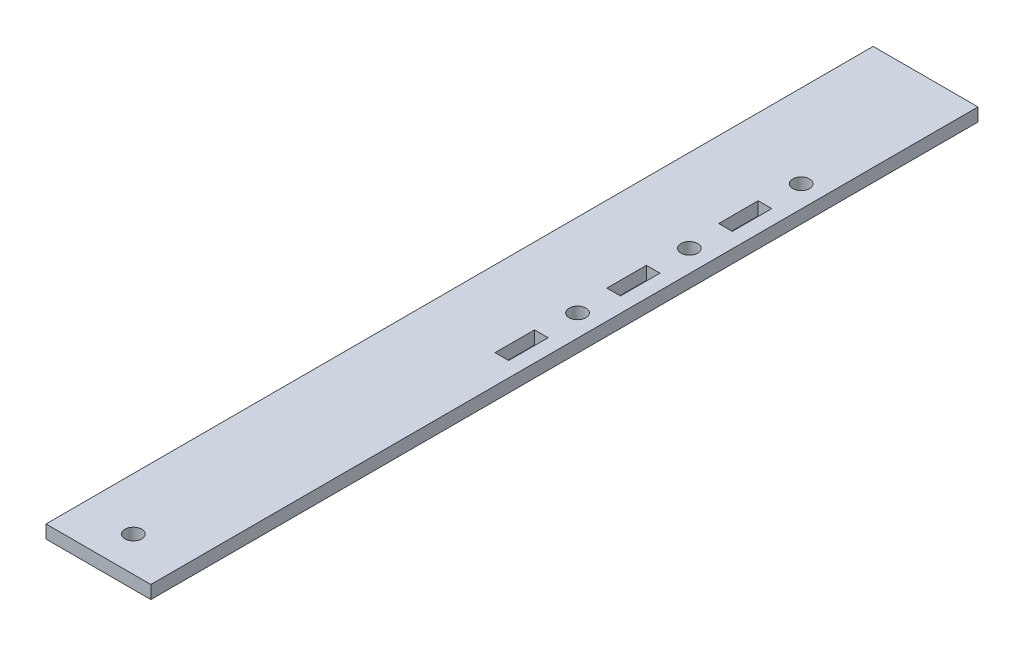
ISO-10303-21;
HEADER;
FILE_DESCRIPTION(('STEP AP214'),'2;1');
FILE_NAME('part.step','',(''),(''),'','','');
FILE_SCHEMA(('AUTOMOTIVE_DESIGN { 1 0 10303 214 1 1 1 1 }'));
ENDSEC;
DATA;
#1=APPLICATION_CONTEXT('core data for automotive mechanical design processes');
#2=APPLICATION_PROTOCOL_DEFINITION('international standard','automotive_design',2000,#1);
#3=PRODUCT_CONTEXT('',#1,'mechanical');
#4=PRODUCT('Part','Part','',(#3));
#5=PRODUCT_RELATED_PRODUCT_CATEGORY('part','',(#4));
#6=PRODUCT_DEFINITION_FORMATION('','',#4);
#7=PRODUCT_DEFINITION_CONTEXT('part definition',#1,'design');
#8=PRODUCT_DEFINITION('design','',#6,#7);
#9=PRODUCT_DEFINITION_SHAPE('','',#8);
#10=(LENGTH_UNIT() NAMED_UNIT(*) SI_UNIT(.MILLI.,.METRE.));
#11=(NAMED_UNIT(*) PLANE_ANGLE_UNIT() SI_UNIT($,.RADIAN.));
#12=(NAMED_UNIT(*) SI_UNIT($,.STERADIAN.) SOLID_ANGLE_UNIT());
#13=UNCERTAINTY_MEASURE_WITH_UNIT(LENGTH_MEASURE(1.E-05),#10,'distance_accuracy_value','');
#14=(GEOMETRIC_REPRESENTATION_CONTEXT(3) GLOBAL_UNCERTAINTY_ASSIGNED_CONTEXT((#13)) GLOBAL_UNIT_ASSIGNED_CONTEXT((#10,
#11,#12)) REPRESENTATION_CONTEXT('',''));
#15=CARTESIAN_POINT('',(0.,0.,0.));
#16=DIRECTION('',(0.,0.,1.));
#17=DIRECTION('',(1.,0.,0.));
#18=AXIS2_PLACEMENT_3D('',#15,#16,#17);
#19=CARTESIAN_POINT('',(19.05,0.,88.9));
#20=DIRECTION('',(0.,1.,0.));
#21=DIRECTION('',(-1.,0.,0.));
#22=AXIS2_PLACEMENT_3D('',#19,#20,#21);
#23=PLANE('',#22);
#24=CARTESIAN_POINT('',(9.525,0.,114.3));
#25=DIRECTION('',(0.,1.,0.));
#26=DIRECTION('',(0.,0.,1.));
#27=AXIS2_PLACEMENT_3D('',#24,#25,#26);
#28=CIRCLE('',#27,1.524);
#29=CARTESIAN_POINT('',(9.525,0.,115.824));
#30=VERTEX_POINT('',#29);
#31=EDGE_CURVE('E183',#30,#30,#28,.T.);
#32=ORIENTED_EDGE('',*,*,#31,.T.);
#33=EDGE_LOOP('',(#32));
#34=FACE_BOUND('',#33,.T.);
#35=DIRECTION('',(0.,0.,-1.));
#36=VECTOR('',#35,1.);
#37=CARTESIAN_POINT('',(16.317595,0.,0.));
#38=LINE('',#37,#36);
#39=CARTESIAN_POINT('',(16.317595,0.,12.2555));
#40=VERTEX_POINT('',#39);
#41=CARTESIAN_POINT('',(16.317595,0.,5.08));
#42=VERTEX_POINT('',#41);
#43=EDGE_CURVE('E203',#40,#42,#38,.T.);
#44=ORIENTED_EDGE('',*,*,#43,.T.);
#45=DIRECTION('',(-1.,0.,0.));
#46=VECTOR('',#45,1.);
#47=CARTESIAN_POINT('',(0.,0.,5.08));
#48=LINE('',#47,#46);
#49=CARTESIAN_POINT('',(13.844905,0.,5.08));
#50=VERTEX_POINT('',#49);
#51=EDGE_CURVE('E192',#42,#50,#48,.T.);
#52=ORIENTED_EDGE('',*,*,#51,.T.);
#53=DIRECTION('',(0.,0.,1.));
#54=VECTOR('',#53,1.);
#55=CARTESIAN_POINT('',(13.844905,0.,0.));
#56=LINE('',#55,#54);
#57=CARTESIAN_POINT('',(13.844905,0.,12.2555));
#58=VERTEX_POINT('',#57);
#59=EDGE_CURVE('E196',#50,#58,#56,.T.);
#60=ORIENTED_EDGE('',*,*,#59,.T.);
#61=DIRECTION('',(1.,0.,0.));
#62=VECTOR('',#61,1.);
#63=CARTESIAN_POINT('',(0.,0.,12.2555));
#64=LINE('',#63,#62);
#65=EDGE_CURVE('E61',#58,#40,#64,.T.);
#66=ORIENTED_EDGE('',*,*,#65,.T.);
#67=EDGE_LOOP('',(#44,#52,#60,#66));
#68=FACE_BOUND('',#67,.T.);
#69=CARTESIAN_POINT('',(15.08125,0.,-1.49225));
#70=DIRECTION('',(0.,1.,0.));
#71=DIRECTION('',(0.,0.,1.));
#72=AXIS2_PLACEMENT_3D('',#69,#70,#71);
#73=CIRCLE('',#72,1.524);
#74=CARTESIAN_POINT('',(15.08125,0.,0.0317499999999964));
#75=VERTEX_POINT('',#74);
#76=EDGE_CURVE('E211',#75,#75,#73,.T.);
#77=ORIENTED_EDGE('',*,*,#76,.T.);
#78=EDGE_LOOP('',(#77));
#79=FACE_BOUND('',#78,.T.);
#80=CARTESIAN_POINT('',(15.08125,0.,18.82775));
#81=DIRECTION('',(0.,1.,0.));
#82=DIRECTION('',(0.,0.,1.));
#83=AXIS2_PLACEMENT_3D('',#80,#81,#82);
#84=CIRCLE('',#83,1.524);
#85=CARTESIAN_POINT('',(15.08125,0.,20.35175));
#86=VERTEX_POINT('',#85);
#87=EDGE_CURVE('E318',#86,#86,#84,.T.);
#88=ORIENTED_EDGE('',*,*,#87,.T.);
#89=EDGE_LOOP('',(#88));
#90=FACE_BOUND('',#89,.T.);
#91=DIRECTION('',(0.,0.,1.));
#92=VECTOR('',#91,1.);
#93=CARTESIAN_POINT('',(16.317595,0.,0.));
#94=LINE('',#93,#92);
#95=CARTESIAN_POINT('',(16.317595,0.,45.72));
#96=VERTEX_POINT('',#95);
#97=CARTESIAN_POINT('',(16.317595,0.,52.8955));
#98=VERTEX_POINT('',#97);
#99=EDGE_CURVE('E253',#96,#98,#94,.T.);
#100=ORIENTED_EDGE('',*,*,#99,.F.);
#101=DIRECTION('',(1.,0.,0.));
#102=VECTOR('',#101,1.);
#103=CARTESIAN_POINT('',(0.,0.,45.72));
#104=LINE('',#103,#102);
#105=CARTESIAN_POINT('',(13.844905,0.,45.72));
#106=VERTEX_POINT('',#105);
#107=EDGE_CURVE('E256',#106,#96,#104,.T.);
#108=ORIENTED_EDGE('',*,*,#107,.F.);
#109=DIRECTION('',(0.,0.,-1.));
#110=VECTOR('',#109,1.);
#111=CARTESIAN_POINT('',(13.844905,0.,0.));
#112=LINE('',#111,#110);
#113=CARTESIAN_POINT('',(13.844905,0.,52.8955));
#114=VERTEX_POINT('',#113);
#115=EDGE_CURVE('E260',#114,#106,#112,.T.);
#116=ORIENTED_EDGE('',*,*,#115,.F.);
#117=DIRECTION('',(1.,0.,0.));
#118=VECTOR('',#117,1.);
#119=CARTESIAN_POINT('',(0.,0.,52.8955));
#120=LINE('',#119,#118);
#121=EDGE_CURVE('E264',#114,#98,#120,.T.);
#122=ORIENTED_EDGE('',*,*,#121,.T.);
#123=EDGE_LOOP('',(#100,#108,#116,#122));
#124=FACE_BOUND('',#123,.T.);
#125=CARTESIAN_POINT('',(15.08125,0.,39.14775));
#126=DIRECTION('',(0.,1.,0.));
#127=DIRECTION('',(0.,0.,1.));
#128=AXIS2_PLACEMENT_3D('',#125,#126,#127);
#129=CIRCLE('',#128,1.524);
#130=CARTESIAN_POINT('',(15.08125,0.,40.67175));
#131=VERTEX_POINT('',#130);
#132=EDGE_CURVE('E347',#131,#131,#129,.T.);
#133=ORIENTED_EDGE('',*,*,#132,.T.);
#134=EDGE_LOOP('',(#133));
#135=FACE_BOUND('',#134,.T.);
#136=DIRECTION('',(0.,0.,-1.));
#137=VECTOR('',#136,1.);
#138=CARTESIAN_POINT('',(0.,0.,88.9));
#139=LINE('',#138,#137);
#140=CARTESIAN_POINT('',(0.,0.,120.65));
#141=VERTEX_POINT('',#140);
#142=CARTESIAN_POINT('',(0.,0.,-29.6545));
#143=VERTEX_POINT('',#142);
#144=EDGE_CURVE('E351',#141,#143,#139,.T.);
#145=ORIENTED_EDGE('',*,*,#144,.T.);
#146=DIRECTION('',(-1.,0.,0.));
#147=VECTOR('',#146,1.);
#148=CARTESIAN_POINT('',(0.,0.,-29.6545));
#149=LINE('',#148,#147);
#150=CARTESIAN_POINT('',(19.05,0.,-29.6545));
#151=VERTEX_POINT('',#150);
#152=EDGE_CURVE('E163',#151,#143,#149,.T.);
#153=ORIENTED_EDGE('',*,*,#152,.F.);
#154=DIRECTION('',(0.,0.,-1.));
#155=VECTOR('',#154,1.);
#156=CARTESIAN_POINT('',(19.05,0.,88.9));
#157=LINE('',#156,#155);
#158=CARTESIAN_POINT('',(19.05,0.,120.65));
#159=VERTEX_POINT('',#158);
#160=EDGE_CURVE('E11',#159,#151,#157,.T.);
#161=ORIENTED_EDGE('',*,*,#160,.F.);
#162=DIRECTION('',(1.,0.,0.));
#163=VECTOR('',#162,1.);
#164=CARTESIAN_POINT('',(0.,0.,120.65));
#165=LINE('',#164,#163);
#166=EDGE_CURVE('E161',#141,#159,#165,.T.);
#167=ORIENTED_EDGE('',*,*,#166,.F.);
#168=EDGE_LOOP('',(#145,#153,#161,#167));
#169=FACE_BOUND('',#168,.T.);
#170=DIRECTION('',(0.,0.,1.));
#171=VECTOR('',#170,1.);
#172=CARTESIAN_POINT('',(16.317595,0.,0.));
#173=LINE('',#172,#171);
#174=CARTESIAN_POINT('',(16.317595,0.,25.4));
#175=VERTEX_POINT('',#174);
#176=CARTESIAN_POINT('',(16.317595,0.,32.5755));
#177=VERTEX_POINT('',#176);
#178=EDGE_CURVE('E298',#175,#177,#173,.T.);
#179=ORIENTED_EDGE('',*,*,#178,.F.);
#180=DIRECTION('',(1.,0.,0.));
#181=VECTOR('',#180,1.);
#182=CARTESIAN_POINT('',(0.,0.,25.4));
#183=LINE('',#182,#181);
#184=CARTESIAN_POINT('',(13.844905,0.,25.4));
#185=VERTEX_POINT('',#184);
#186=EDGE_CURVE('E301',#185,#175,#183,.T.);
#187=ORIENTED_EDGE('',*,*,#186,.F.);
#188=DIRECTION('',(0.,0.,-1.));
#189=VECTOR('',#188,1.);
#190=CARTESIAN_POINT('',(13.844905,0.,0.));
#191=LINE('',#190,#189);
#192=CARTESIAN_POINT('',(13.844905,0.,32.5755));
#193=VERTEX_POINT('',#192);
#194=EDGE_CURVE('E305',#193,#185,#191,.T.);
#195=ORIENTED_EDGE('',*,*,#194,.F.);
#196=DIRECTION('',(-1.,0.,0.));
#197=VECTOR('',#196,1.);
#198=CARTESIAN_POINT('',(0.,0.,32.5755));
#199=LINE('',#198,#197);
#200=EDGE_CURVE('E309',#177,#193,#199,.T.);
#201=ORIENTED_EDGE('',*,*,#200,.F.);
#202=EDGE_LOOP('',(#179,#187,#195,#201));
#203=FACE_BOUND('',#202,.T.);
#204=ADVANCED_FACE('F46',(#34,#68,#79,#90,#124,#135,#169,#203),#23,.F.);
#205=CARTESIAN_POINT('',(0.,2.38125,88.9));
#206=DIRECTION('',(0.,-1.,0.));
#207=DIRECTION('',(0.,0.,-1.));
#208=AXIS2_PLACEMENT_3D('',#205,#206,#207);
#209=PLANE('',#208);
#210=CARTESIAN_POINT('',(9.525,2.38125,114.3));
#211=DIRECTION('',(0.,1.,0.));
#212=DIRECTION('',(0.,0.,1.));
#213=AXIS2_PLACEMENT_3D('',#210,#211,#212);
#214=CIRCLE('',#213,1.524);
#215=CARTESIAN_POINT('',(9.525,2.38125,115.824));
#216=VERTEX_POINT('',#215);
#217=EDGE_CURVE('E186',#216,#216,#214,.T.);
#218=ORIENTED_EDGE('',*,*,#217,.F.);
#219=EDGE_LOOP('',(#218));
#220=FACE_BOUND('',#219,.T.);
#221=DIRECTION('',(0.,0.,1.));
#222=VECTOR('',#221,1.);
#223=CARTESIAN_POINT('',(13.844905,2.38125,0.));
#224=LINE('',#223,#222);
#225=CARTESIAN_POINT('',(13.844905,2.38125,5.08));
#226=VERTEX_POINT('',#225);
#227=CARTESIAN_POINT('',(13.844905,2.38125,12.2555));
#228=VERTEX_POINT('',#227);
#229=EDGE_CURVE('E210',#226,#228,#224,.T.);
#230=ORIENTED_EDGE('',*,*,#229,.F.);
#231=DIRECTION('',(-1.,0.,0.));
#232=VECTOR('',#231,1.);
#233=CARTESIAN_POINT('',(0.,2.38125,5.08));
#234=LINE('',#233,#232);
#235=CARTESIAN_POINT('',(16.317595,2.38125,5.08));
#236=VERTEX_POINT('',#235);
#237=EDGE_CURVE('E69',#236,#226,#234,.T.);
#238=ORIENTED_EDGE('',*,*,#237,.F.);
#239=DIRECTION('',(0.,0.,-1.));
#240=VECTOR('',#239,1.);
#241=CARTESIAN_POINT('',(16.317595,2.38125,0.));
#242=LINE('',#241,#240);
#243=CARTESIAN_POINT('',(16.317595,2.38125,12.2555));
#244=VERTEX_POINT('',#243);
#245=EDGE_CURVE('E197',#244,#236,#242,.T.);
#246=ORIENTED_EDGE('',*,*,#245,.F.);
#247=DIRECTION('',(1.,0.,0.));
#248=VECTOR('',#247,1.);
#249=CARTESIAN_POINT('',(0.,2.38125,12.2555));
#250=LINE('',#249,#248);
#251=EDGE_CURVE('E215',#228,#244,#250,.T.);
#252=ORIENTED_EDGE('',*,*,#251,.F.);
#253=EDGE_LOOP('',(#230,#238,#246,#252));
#254=FACE_BOUND('',#253,.T.);
#255=CARTESIAN_POINT('',(15.08125,2.38125,-1.49225));
#256=DIRECTION('',(0.,1.,0.));
#257=DIRECTION('',(0.,0.,1.));
#258=AXIS2_PLACEMENT_3D('',#255,#256,#257);
#259=CIRCLE('',#258,1.524);
#260=CARTESIAN_POINT('',(15.08125,2.38125,0.0317499999999964));
#261=VERTEX_POINT('',#260);
#262=EDGE_CURVE('E190',#261,#261,#259,.T.);
#263=ORIENTED_EDGE('',*,*,#262,.F.);
#264=EDGE_LOOP('',(#263));
#265=FACE_BOUND('',#264,.T.);
#266=CARTESIAN_POINT('',(15.08125,2.38125,18.82775));
#267=DIRECTION('',(0.,1.,0.));
#268=DIRECTION('',(0.,0.,1.));
#269=AXIS2_PLACEMENT_3D('',#266,#267,#268);
#270=CIRCLE('',#269,1.524);
#271=CARTESIAN_POINT('',(15.08125,2.38125,20.35175));
#272=VERTEX_POINT('',#271);
#273=EDGE_CURVE('E250',#272,#272,#270,.T.);
#274=ORIENTED_EDGE('',*,*,#273,.F.);
#275=EDGE_LOOP('',(#274));
#276=FACE_BOUND('',#275,.T.);
#277=DIRECTION('',(0.,0.,1.));
#278=VECTOR('',#277,1.);
#279=CARTESIAN_POINT('',(16.317595,2.38125,0.));
#280=LINE('',#279,#278);
#281=CARTESIAN_POINT('',(16.317595,2.38125,45.72));
#282=VERTEX_POINT('',#281);
#283=CARTESIAN_POINT('',(16.317595,2.38125,52.8955));
#284=VERTEX_POINT('',#283);
#285=EDGE_CURVE('E269',#282,#284,#280,.T.);
#286=ORIENTED_EDGE('',*,*,#285,.T.);
#287=DIRECTION('',(1.,0.,0.));
#288=VECTOR('',#287,1.);
#289=CARTESIAN_POINT('',(0.,2.38125,52.8955));
#290=LINE('',#289,#288);
#291=CARTESIAN_POINT('',(13.844905,2.38125,52.8955));
#292=VERTEX_POINT('',#291);
#293=EDGE_CURVE('E257',#292,#284,#290,.T.);
#294=ORIENTED_EDGE('',*,*,#293,.F.);
#295=DIRECTION('',(0.,0.,-1.));
#296=VECTOR('',#295,1.);
#297=CARTESIAN_POINT('',(13.844905,2.38125,0.));
#298=LINE('',#297,#296);
#299=CARTESIAN_POINT('',(13.844905,2.38125,45.72));
#300=VERTEX_POINT('',#299);
#301=EDGE_CURVE('E278',#292,#300,#298,.T.);
#302=ORIENTED_EDGE('',*,*,#301,.T.);
#303=DIRECTION('',(1.,0.,0.));
#304=VECTOR('',#303,1.);
#305=CARTESIAN_POINT('',(0.,2.38125,45.72));
#306=LINE('',#305,#304);
#307=EDGE_CURVE('E273',#300,#282,#306,.T.);
#308=ORIENTED_EDGE('',*,*,#307,.T.);
#309=EDGE_LOOP('',(#286,#294,#302,#308));
#310=FACE_BOUND('',#309,.T.);
#311=CARTESIAN_POINT('',(15.08125,2.38125,39.14775));
#312=DIRECTION('',(0.,1.,0.));
#313=DIRECTION('',(0.,0.,1.));
#314=AXIS2_PLACEMENT_3D('',#311,#312,#313);
#315=CIRCLE('',#314,1.524);
#316=CARTESIAN_POINT('',(15.08125,2.38125,40.67175));
#317=VERTEX_POINT('',#316);
#318=EDGE_CURVE('E288',#317,#317,#315,.T.);
#319=ORIENTED_EDGE('',*,*,#318,.F.);
#320=EDGE_LOOP('',(#319));
#321=FACE_BOUND('',#320,.T.);
#322=DIRECTION('',(0.,0.,-1.));
#323=VECTOR('',#322,1.);
#324=CARTESIAN_POINT('',(19.05,2.38125,88.9));
#325=LINE('',#324,#323);
#326=CARTESIAN_POINT('',(19.05,2.38125,120.65));
#327=VERTEX_POINT('',#326);
#328=CARTESIAN_POINT('',(19.05,2.38125,-29.6545));
#329=VERTEX_POINT('',#328);
#330=EDGE_CURVE('E54',#327,#329,#325,.T.);
#331=ORIENTED_EDGE('',*,*,#330,.T.);
#332=DIRECTION('',(-1.,0.,0.));
#333=VECTOR('',#332,1.);
#334=CARTESIAN_POINT('',(0.,2.38125,-29.6545));
#335=LINE('',#334,#333);
#336=CARTESIAN_POINT('',(0.,2.38125,-29.6545));
#337=VERTEX_POINT('',#336);
#338=EDGE_CURVE('E225',#329,#337,#335,.T.);
#339=ORIENTED_EDGE('',*,*,#338,.T.);
#340=DIRECTION('',(0.,0.,-1.));
#341=VECTOR('',#340,1.);
#342=CARTESIAN_POINT('',(0.,2.38125,88.9));
#343=LINE('',#342,#341);
#344=CARTESIAN_POINT('',(0.,2.38125,120.65));
#345=VERTEX_POINT('',#344);
#346=EDGE_CURVE('E357',#345,#337,#343,.T.);
#347=ORIENTED_EDGE('',*,*,#346,.F.);
#348=DIRECTION('',(1.,0.,0.));
#349=VECTOR('',#348,1.);
#350=CARTESIAN_POINT('',(0.,2.38125,120.65));
#351=LINE('',#350,#349);
#352=EDGE_CURVE('E180',#345,#327,#351,.T.);
#353=ORIENTED_EDGE('',*,*,#352,.T.);
#354=EDGE_LOOP('',(#331,#339,#347,#353));
#355=FACE_BOUND('',#354,.T.);
#356=DIRECTION('',(0.,0.,1.));
#357=VECTOR('',#356,1.);
#358=CARTESIAN_POINT('',(16.317595,2.38125,0.));
#359=LINE('',#358,#357);
#360=CARTESIAN_POINT('',(16.317595,2.38125,25.4));
#361=VERTEX_POINT('',#360);
#362=CARTESIAN_POINT('',(16.317595,2.38125,32.5755));
#363=VERTEX_POINT('',#362);
#364=EDGE_CURVE('E313',#361,#363,#359,.T.);
#365=ORIENTED_EDGE('',*,*,#364,.T.);
#366=DIRECTION('',(-1.,0.,0.));
#367=VECTOR('',#366,1.);
#368=CARTESIAN_POINT('',(0.,2.38125,32.5755));
#369=LINE('',#368,#367);
#370=CARTESIAN_POINT('',(13.844905,2.38125,32.5755));
#371=VERTEX_POINT('',#370);
#372=EDGE_CURVE('E302',#363,#371,#369,.T.);
#373=ORIENTED_EDGE('',*,*,#372,.T.);
#374=DIRECTION('',(0.,0.,-1.));
#375=VECTOR('',#374,1.);
#376=CARTESIAN_POINT('',(13.844905,2.38125,0.));
#377=LINE('',#376,#375);
#378=CARTESIAN_POINT('',(13.844905,2.38125,25.4));
#379=VERTEX_POINT('',#378);
#380=EDGE_CURVE('E322',#371,#379,#377,.T.);
#381=ORIENTED_EDGE('',*,*,#380,.T.);
#382=DIRECTION('',(1.,0.,0.));
#383=VECTOR('',#382,1.);
#384=CARTESIAN_POINT('',(0.,2.38125,25.4));
#385=LINE('',#384,#383);
#386=EDGE_CURVE('E317',#379,#361,#385,.T.);
#387=ORIENTED_EDGE('',*,*,#386,.T.);
#388=EDGE_LOOP('',(#365,#373,#381,#387));
#389=FACE_BOUND('',#388,.T.);
#390=ADVANCED_FACE('F361',(#220,#254,#265,#276,#310,#321,#355,#389),#209,.F.);
#391=CARTESIAN_POINT('',(19.05,2.38125,88.9));
#392=DIRECTION('',(-1.,0.,0.));
#393=DIRECTION('',(0.,0.,1.));
#394=AXIS2_PLACEMENT_3D('',#391,#392,#393);
#395=PLANE('',#394);
#396=ORIENTED_EDGE('',*,*,#160,.T.);
#397=DIRECTION('',(0.,1.,0.));
#398=VECTOR('',#397,1.);
#399=CARTESIAN_POINT('',(19.05,0.,-29.6545));
#400=LINE('',#399,#398);
#401=EDGE_CURVE('E242',#151,#329,#400,.T.);
#402=ORIENTED_EDGE('',*,*,#401,.T.);
#403=ORIENTED_EDGE('',*,*,#330,.F.);
#404=DIRECTION('',(0.,1.,0.));
#405=VECTOR('',#404,1.);
#406=CARTESIAN_POINT('',(19.05,0.,120.65));
#407=LINE('',#406,#405);
#408=EDGE_CURVE('E168',#159,#327,#407,.T.);
#409=ORIENTED_EDGE('',*,*,#408,.F.);
#410=EDGE_LOOP('',(#396,#402,#403,#409));
#411=FACE_BOUND('',#410,.T.);
#412=ADVANCED_FACE('F169',(#411),#395,.F.);
#413=CARTESIAN_POINT('',(0.,0.,88.9));
#414=DIRECTION('',(1.,0.,0.));
#415=DIRECTION('',(0.,0.,-1.));
#416=AXIS2_PLACEMENT_3D('',#413,#414,#415);
#417=PLANE('',#416);
#418=ORIENTED_EDGE('',*,*,#346,.T.);
#419=DIRECTION('',(0.,1.,0.));
#420=VECTOR('',#419,1.);
#421=CARTESIAN_POINT('',(0.,0.,-29.6545));
#422=LINE('',#421,#420);
#423=EDGE_CURVE('E246',#143,#337,#422,.T.);
#424=ORIENTED_EDGE('',*,*,#423,.F.);
#425=ORIENTED_EDGE('',*,*,#144,.F.);
#426=DIRECTION('',(0.,1.,0.));
#427=VECTOR('',#426,1.);
#428=CARTESIAN_POINT('',(0.,0.,120.65));
#429=LINE('',#428,#427);
#430=EDGE_CURVE('E174',#141,#345,#429,.T.);
#431=ORIENTED_EDGE('',*,*,#430,.T.);
#432=EDGE_LOOP('',(#418,#424,#425,#431));
#433=FACE_BOUND('',#432,.T.);
#434=ADVANCED_FACE('F368',(#433),#417,.F.);
#435=CARTESIAN_POINT('',(15.08125,0.,39.14775));
#436=DIRECTION('',(0.,1.,0.));
#437=DIRECTION('',(0.,0.,1.));
#438=AXIS2_PLACEMENT_3D('',#435,#436,#437);
#439=CYLINDRICAL_SURFACE('',#438,1.524);
#440=ORIENTED_EDGE('',*,*,#132,.F.);
#441=EDGE_LOOP('',(#440));
#442=FACE_BOUND('',#441,.T.);
#443=ORIENTED_EDGE('',*,*,#318,.T.);
#444=EDGE_LOOP('',(#443));
#445=FACE_BOUND('',#444,.T.);
#446=ADVANCED_FACE('F370',(#442,#445),#439,.F.);
#447=CARTESIAN_POINT('',(16.317595,0.,0.));
#448=DIRECTION('',(-1.,0.,0.));
#449=DIRECTION('',(0.,0.,1.));
#450=AXIS2_PLACEMENT_3D('',#447,#448,#449);
#451=PLANE('',#450);
#452=ORIENTED_EDGE('',*,*,#285,.F.);
#453=DIRECTION('',(0.,1.,0.));
#454=VECTOR('',#453,1.);
#455=CARTESIAN_POINT('',(16.317595,0.,45.72));
#456=LINE('',#455,#454);
#457=EDGE_CURVE('E268',#96,#282,#456,.T.);
#458=ORIENTED_EDGE('',*,*,#457,.F.);
#459=ORIENTED_EDGE('',*,*,#99,.T.);
#460=DIRECTION('',(0.,1.,0.));
#461=VECTOR('',#460,1.);
#462=CARTESIAN_POINT('',(16.317595,0.,52.8955));
#463=LINE('',#462,#461);
#464=EDGE_CURVE('E285',#98,#284,#463,.T.);
#465=ORIENTED_EDGE('',*,*,#464,.T.);
#466=EDGE_LOOP('',(#452,#458,#459,#465));
#467=FACE_BOUND('',#466,.T.);
#468=ADVANCED_FACE('F377',(#467),#451,.T.);
#469=CARTESIAN_POINT('',(0.,0.,52.8955));
#470=DIRECTION('',(0.,0.,1.));
#471=DIRECTION('',(1.,0.,0.));
#472=AXIS2_PLACEMENT_3D('',#469,#470,#471);
#473=PLANE('',#472);
#474=ORIENTED_EDGE('',*,*,#293,.T.);
#475=ORIENTED_EDGE('',*,*,#464,.F.);
#476=ORIENTED_EDGE('',*,*,#121,.F.);
#477=DIRECTION('',(0.,1.,0.));
#478=VECTOR('',#477,1.);
#479=CARTESIAN_POINT('',(13.844905,0.,52.8955));
#480=LINE('',#479,#478);
#481=EDGE_CURVE('E289',#114,#292,#480,.T.);
#482=ORIENTED_EDGE('',*,*,#481,.T.);
#483=EDGE_LOOP('',(#474,#475,#476,#482));
#484=FACE_BOUND('',#483,.T.);
#485=ADVANCED_FACE('F409',(#484),#473,.F.);
#486=CARTESIAN_POINT('',(13.844905,0.,0.));
#487=DIRECTION('',(1.,0.,0.));
#488=DIRECTION('',(0.,0.,-1.));
#489=AXIS2_PLACEMENT_3D('',#486,#487,#488);
#490=PLANE('',#489);
#491=ORIENTED_EDGE('',*,*,#301,.F.);
#492=ORIENTED_EDGE('',*,*,#481,.F.);
#493=ORIENTED_EDGE('',*,*,#115,.T.);
#494=DIRECTION('',(0.,1.,0.));
#495=VECTOR('',#494,1.);
#496=CARTESIAN_POINT('',(13.844905,0.,45.72));
#497=LINE('',#496,#495);
#498=EDGE_CURVE('E292',#106,#300,#497,.T.);
#499=ORIENTED_EDGE('',*,*,#498,.T.);
#500=EDGE_LOOP('',(#491,#492,#493,#499));
#501=FACE_BOUND('',#500,.T.);
#502=ADVANCED_FACE('F417',(#501),#490,.T.);
#503=CARTESIAN_POINT('',(0.,0.,45.72));
#504=DIRECTION('',(0.,0.,1.));
#505=DIRECTION('',(1.,0.,0.));
#506=AXIS2_PLACEMENT_3D('',#503,#504,#505);
#507=PLANE('',#506);
#508=ORIENTED_EDGE('',*,*,#307,.F.);
#509=ORIENTED_EDGE('',*,*,#498,.F.);
#510=ORIENTED_EDGE('',*,*,#107,.T.);
#511=ORIENTED_EDGE('',*,*,#457,.T.);
#512=EDGE_LOOP('',(#508,#509,#510,#511));
#513=FACE_BOUND('',#512,.T.);
#514=ADVANCED_FACE('F415',(#513),#507,.T.);
#515=CARTESIAN_POINT('',(16.317595,0.,0.));
#516=DIRECTION('',(-1.,0.,0.));
#517=DIRECTION('',(0.,0.,1.));
#518=AXIS2_PLACEMENT_3D('',#515,#516,#517);
#519=PLANE('',#518);
#520=ORIENTED_EDGE('',*,*,#364,.F.);
#521=DIRECTION('',(0.,1.,0.));
#522=VECTOR('',#521,1.);
#523=CARTESIAN_POINT('',(16.317595,0.,25.4));
#524=LINE('',#523,#522);
#525=EDGE_CURVE('E312',#175,#361,#524,.T.);
#526=ORIENTED_EDGE('',*,*,#525,.F.);
#527=ORIENTED_EDGE('',*,*,#178,.T.);
#528=DIRECTION('',(0.,1.,0.));
#529=VECTOR('',#528,1.);
#530=CARTESIAN_POINT('',(16.317595,0.,32.5755));
#531=LINE('',#530,#529);
#532=EDGE_CURVE('E274',#177,#363,#531,.T.);
#533=ORIENTED_EDGE('',*,*,#532,.T.);
#534=EDGE_LOOP('',(#520,#526,#527,#533));
#535=FACE_BOUND('',#534,.T.);
#536=ADVANCED_FACE('F424',(#535),#519,.T.);
#537=CARTESIAN_POINT('',(0.,0.,32.5755));
#538=DIRECTION('',(0.,0.,-1.));
#539=DIRECTION('',(-1.,0.,0.));
#540=AXIS2_PLACEMENT_3D('',#537,#538,#539);
#541=PLANE('',#540);
#542=ORIENTED_EDGE('',*,*,#372,.F.);
#543=ORIENTED_EDGE('',*,*,#532,.F.);
#544=ORIENTED_EDGE('',*,*,#200,.T.);
#545=DIRECTION('',(0.,1.,0.));
#546=VECTOR('',#545,1.);
#547=CARTESIAN_POINT('',(13.844905,0.,32.5755));
#548=LINE('',#547,#546);
#549=EDGE_CURVE('E332',#193,#371,#548,.T.);
#550=ORIENTED_EDGE('',*,*,#549,.T.);
#551=EDGE_LOOP('',(#542,#543,#544,#550));
#552=FACE_BOUND('',#551,.T.);
#553=ADVANCED_FACE('F431',(#552),#541,.T.);
#554=CARTESIAN_POINT('',(13.844905,0.,0.));
#555=DIRECTION('',(1.,0.,0.));
#556=DIRECTION('',(0.,0.,-1.));
#557=AXIS2_PLACEMENT_3D('',#554,#555,#556);
#558=PLANE('',#557);
#559=ORIENTED_EDGE('',*,*,#380,.F.);
#560=ORIENTED_EDGE('',*,*,#549,.F.);
#561=ORIENTED_EDGE('',*,*,#194,.T.);
#562=DIRECTION('',(0.,1.,0.));
#563=VECTOR('',#562,1.);
#564=CARTESIAN_POINT('',(13.844905,0.,25.4));
#565=LINE('',#564,#563);
#566=EDGE_CURVE('E335',#185,#379,#565,.T.);
#567=ORIENTED_EDGE('',*,*,#566,.T.);
#568=EDGE_LOOP('',(#559,#560,#561,#567));
#569=FACE_BOUND('',#568,.T.);
#570=ADVANCED_FACE('F434',(#569),#558,.T.);
#571=CARTESIAN_POINT('',(0.,0.,25.4));
#572=DIRECTION('',(0.,0.,1.));
#573=DIRECTION('',(1.,0.,0.));
#574=AXIS2_PLACEMENT_3D('',#571,#572,#573);
#575=PLANE('',#574);
#576=ORIENTED_EDGE('',*,*,#386,.F.);
#577=ORIENTED_EDGE('',*,*,#566,.F.);
#578=ORIENTED_EDGE('',*,*,#186,.T.);
#579=ORIENTED_EDGE('',*,*,#525,.T.);
#580=EDGE_LOOP('',(#576,#577,#578,#579));
#581=FACE_BOUND('',#580,.T.);
#582=ADVANCED_FACE('F438',(#581),#575,.T.);
#583=CARTESIAN_POINT('',(15.08125,0.,18.82775));
#584=DIRECTION('',(0.,1.,0.));
#585=DIRECTION('',(0.,0.,1.));
#586=AXIS2_PLACEMENT_3D('',#583,#584,#585);
#587=CYLINDRICAL_SURFACE('',#586,1.524);
#588=ORIENTED_EDGE('',*,*,#87,.F.);
#589=EDGE_LOOP('',(#588));
#590=FACE_BOUND('',#589,.T.);
#591=ORIENTED_EDGE('',*,*,#273,.T.);
#592=EDGE_LOOP('',(#591));
#593=FACE_BOUND('',#592,.T.);
#594=ADVANCED_FACE('F442',(#590,#593),#587,.F.);
#595=CARTESIAN_POINT('',(0.,0.,-29.6545));
#596=DIRECTION('',(0.,0.,-1.));
#597=DIRECTION('',(-1.,0.,0.));
#598=AXIS2_PLACEMENT_3D('',#595,#596,#597);
#599=PLANE('',#598);
#600=ORIENTED_EDGE('',*,*,#338,.F.);
#601=ORIENTED_EDGE('',*,*,#401,.F.);
#602=ORIENTED_EDGE('',*,*,#152,.T.);
#603=ORIENTED_EDGE('',*,*,#423,.T.);
#604=EDGE_LOOP('',(#600,#601,#602,#603));
#605=FACE_BOUND('',#604,.T.);
#606=ADVANCED_FACE('F365',(#605),#599,.T.);
#607=CARTESIAN_POINT('',(15.08125,0.,-1.49225));
#608=DIRECTION('',(0.,1.,0.));
#609=DIRECTION('',(0.,0.,1.));
#610=AXIS2_PLACEMENT_3D('',#607,#608,#609);
#611=CYLINDRICAL_SURFACE('',#610,1.524);
#612=ORIENTED_EDGE('',*,*,#76,.F.);
#613=EDGE_LOOP('',(#612));
#614=FACE_BOUND('',#613,.T.);
#615=ORIENTED_EDGE('',*,*,#262,.T.);
#616=EDGE_LOOP('',(#615));
#617=FACE_BOUND('',#616,.T.);
#618=ADVANCED_FACE('F452',(#614,#617),#611,.F.);
#619=CARTESIAN_POINT('',(0.,0.,5.08));
#620=DIRECTION('',(0.,0.,-1.));
#621=DIRECTION('',(-1.,0.,0.));
#622=AXIS2_PLACEMENT_3D('',#619,#620,#621);
#623=PLANE('',#622);
#624=ORIENTED_EDGE('',*,*,#237,.T.);
#625=DIRECTION('',(0.,1.,0.));
#626=VECTOR('',#625,1.);
#627=CARTESIAN_POINT('',(13.844905,0.,5.08));
#628=LINE('',#627,#626);
#629=EDGE_CURVE('E207',#50,#226,#628,.T.);
#630=ORIENTED_EDGE('',*,*,#629,.F.);
#631=ORIENTED_EDGE('',*,*,#51,.F.);
#632=DIRECTION('',(0.,1.,0.));
#633=VECTOR('',#632,1.);
#634=CARTESIAN_POINT('',(16.317595,0.,5.08));
#635=LINE('',#634,#633);
#636=EDGE_CURVE('E222',#42,#236,#635,.T.);
#637=ORIENTED_EDGE('',*,*,#636,.T.);
#638=EDGE_LOOP('',(#624,#630,#631,#637));
#639=FACE_BOUND('',#638,.T.);
#640=ADVANCED_FACE('F459',(#639),#623,.F.);
#641=CARTESIAN_POINT('',(16.317595,0.,0.));
#642=DIRECTION('',(1.,0.,0.));
#643=DIRECTION('',(0.,0.,-1.));
#644=AXIS2_PLACEMENT_3D('',#641,#642,#643);
#645=PLANE('',#644);
#646=ORIENTED_EDGE('',*,*,#245,.T.);
#647=ORIENTED_EDGE('',*,*,#636,.F.);
#648=ORIENTED_EDGE('',*,*,#43,.F.);
#649=DIRECTION('',(0.,1.,0.));
#650=VECTOR('',#649,1.);
#651=CARTESIAN_POINT('',(16.317595,0.,12.2555));
#652=LINE('',#651,#650);
#653=EDGE_CURVE('E226',#40,#244,#652,.T.);
#654=ORIENTED_EDGE('',*,*,#653,.T.);
#655=EDGE_LOOP('',(#646,#647,#648,#654));
#656=FACE_BOUND('',#655,.T.);
#657=ADVANCED_FACE('F465',(#656),#645,.F.);
#658=CARTESIAN_POINT('',(0.,0.,12.2555));
#659=DIRECTION('',(0.,0.,1.));
#660=DIRECTION('',(1.,0.,0.));
#661=AXIS2_PLACEMENT_3D('',#658,#659,#660);
#662=PLANE('',#661);
#663=ORIENTED_EDGE('',*,*,#251,.T.);
#664=ORIENTED_EDGE('',*,*,#653,.F.);
#665=ORIENTED_EDGE('',*,*,#65,.F.);
#666=DIRECTION('',(0.,1.,0.));
#667=VECTOR('',#666,1.);
#668=CARTESIAN_POINT('',(13.844905,0.,12.2555));
#669=LINE('',#668,#667);
#670=EDGE_CURVE('E229',#58,#228,#669,.T.);
#671=ORIENTED_EDGE('',*,*,#670,.T.);
#672=EDGE_LOOP('',(#663,#664,#665,#671));
#673=FACE_BOUND('',#672,.T.);
#674=ADVANCED_FACE('F469',(#673),#662,.F.);
#675=CARTESIAN_POINT('',(13.844905,0.,0.));
#676=DIRECTION('',(-1.,0.,0.));
#677=DIRECTION('',(0.,0.,1.));
#678=AXIS2_PLACEMENT_3D('',#675,#676,#677);
#679=PLANE('',#678);
#680=ORIENTED_EDGE('',*,*,#229,.T.);
#681=ORIENTED_EDGE('',*,*,#670,.F.);
#682=ORIENTED_EDGE('',*,*,#59,.F.);
#683=ORIENTED_EDGE('',*,*,#629,.T.);
#684=EDGE_LOOP('',(#680,#681,#682,#683));
#685=FACE_BOUND('',#684,.T.);
#686=ADVANCED_FACE('F466',(#685),#679,.F.);
#687=CARTESIAN_POINT('',(0.,0.,120.65));
#688=DIRECTION('',(0.,0.,1.));
#689=DIRECTION('',(1.,0.,0.));
#690=AXIS2_PLACEMENT_3D('',#687,#688,#689);
#691=PLANE('',#690);
#692=ORIENTED_EDGE('',*,*,#352,.F.);
#693=ORIENTED_EDGE('',*,*,#430,.F.);
#694=ORIENTED_EDGE('',*,*,#166,.T.);
#695=ORIENTED_EDGE('',*,*,#408,.T.);
#696=EDGE_LOOP('',(#692,#693,#694,#695));
#697=FACE_BOUND('',#696,.T.);
#698=ADVANCED_FACE('F177',(#697),#691,.T.);
#699=CARTESIAN_POINT('',(9.525,0.,114.3));
#700=DIRECTION('',(0.,1.,0.));
#701=DIRECTION('',(0.,0.,1.));
#702=AXIS2_PLACEMENT_3D('',#699,#700,#701);
#703=CYLINDRICAL_SURFACE('',#702,1.524);
#704=ORIENTED_EDGE('',*,*,#31,.F.);
#705=EDGE_LOOP('',(#704));
#706=FACE_BOUND('',#705,.T.);
#707=ORIENTED_EDGE('',*,*,#217,.T.);
#708=EDGE_LOOP('',(#707));
#709=FACE_BOUND('',#708,.T.);
#710=ADVANCED_FACE('F477',(#706,#709),#703,.F.);
#711=CLOSED_SHELL('',(#204,#390,#412,#434,#446,#468,#485,#502,#514,#536,#553,#570,#582,#594,
#606,#618,#640,#657,#674,#686,#698,#710));
#712=MANIFOLD_SOLID_BREP('B2',#711);
#713=ADVANCED_BREP_SHAPE_REPRESENTATION('',(#18,#712),#14);
#714=SHAPE_DEFINITION_REPRESENTATION(#9,#713);
ENDSEC;
END-ISO-10303-21;
